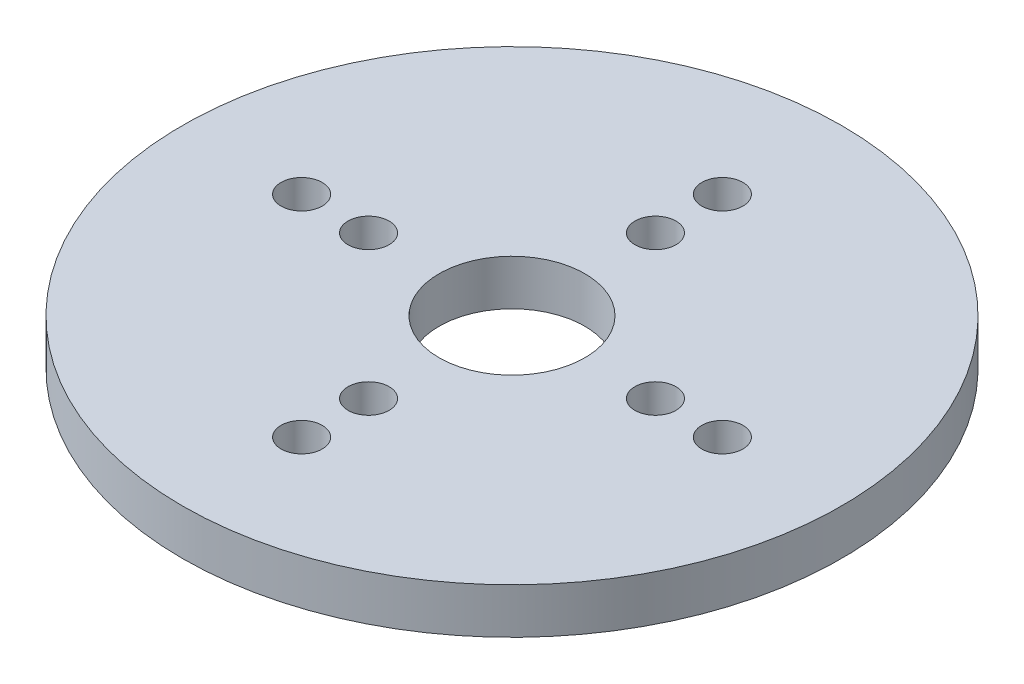
ISO-10303-21;
HEADER;
FILE_DESCRIPTION(('STEP AP214'),'2;1');
FILE_NAME('part.step','',(''),(''),'','','');
FILE_SCHEMA(('AUTOMOTIVE_DESIGN { 1 0 10303 214 1 1 1 1 }'));
ENDSEC;
DATA;
#1=APPLICATION_CONTEXT('core data for automotive mechanical design processes');
#2=APPLICATION_PROTOCOL_DEFINITION('international standard','automotive_design',2000,#1);
#3=PRODUCT_CONTEXT('',#1,'mechanical');
#4=PRODUCT('Part','Part','',(#3));
#5=PRODUCT_RELATED_PRODUCT_CATEGORY('part','',(#4));
#6=PRODUCT_DEFINITION_FORMATION('','',#4);
#7=PRODUCT_DEFINITION_CONTEXT('part definition',#1,'design');
#8=PRODUCT_DEFINITION('design','',#6,#7);
#9=PRODUCT_DEFINITION_SHAPE('','',#8);
#10=(LENGTH_UNIT() NAMED_UNIT(*) SI_UNIT(.MILLI.,.METRE.));
#11=(NAMED_UNIT(*) PLANE_ANGLE_UNIT() SI_UNIT($,.RADIAN.));
#12=(NAMED_UNIT(*) SI_UNIT($,.STERADIAN.) SOLID_ANGLE_UNIT());
#13=UNCERTAINTY_MEASURE_WITH_UNIT(LENGTH_MEASURE(1.E-05),#10,'distance_accuracy_value','');
#14=(GEOMETRIC_REPRESENTATION_CONTEXT(3) GLOBAL_UNCERTAINTY_ASSIGNED_CONTEXT((#13)) GLOBAL_UNIT_ASSIGNED_CONTEXT((#10,
#11,#12)) REPRESENTATION_CONTEXT('',''));
#15=CARTESIAN_POINT('',(0.,0.,0.));
#16=DIRECTION('',(0.,0.,1.));
#17=DIRECTION('',(1.,0.,0.));
#18=AXIS2_PLACEMENT_3D('',#15,#16,#17);
#19=CARTESIAN_POINT('',(0.,4.7625,8.26465172548552));
#20=DIRECTION('',(0.,-1.,0.));
#21=DIRECTION('',(0.,0.,-1.));
#22=AXIS2_PLACEMENT_3D('',#19,#20,#21);
#23=CYLINDRICAL_SURFACE('',#22,7.62);
#24=CARTESIAN_POINT('',(0.,4.7625,8.26465172548552));
#25=DIRECTION('',(0.,1.,0.));
#26=DIRECTION('',(0.,0.,1.));
#27=AXIS2_PLACEMENT_3D('',#24,#25,#26);
#28=CIRCLE('',#27,7.62);
#29=CARTESIAN_POINT('',(0.,4.7625,15.8846517254855));
#30=VERTEX_POINT('',#29);
#31=EDGE_CURVE('E46',#30,#30,#28,.T.);
#32=ORIENTED_EDGE('',*,*,#31,.T.);
#33=EDGE_LOOP('',(#32));
#34=FACE_BOUND('',#33,.T.);
#35=CARTESIAN_POINT('',(0.,0.,8.26465172548552));
#36=DIRECTION('',(0.,1.,0.));
#37=DIRECTION('',(0.,0.,1.));
#38=AXIS2_PLACEMENT_3D('',#35,#36,#37);
#39=CIRCLE('',#38,7.62);
#40=CARTESIAN_POINT('',(0.,0.,15.8846517254855));
#41=VERTEX_POINT('',#40);
#42=EDGE_CURVE('E78',#41,#41,#39,.T.);
#43=ORIENTED_EDGE('',*,*,#42,.F.);
#44=EDGE_LOOP('',(#43));
#45=FACE_BOUND('',#44,.T.);
#46=ADVANCED_FACE('F38',(#34,#45),#23,.F.);
#47=CARTESIAN_POINT('',(2.32452945780892E-13,4.7625,-13.7353482745145));
#48=DIRECTION('',(0.,-1.,0.));
#49=DIRECTION('',(0.,0.,-1.));
#50=AXIS2_PLACEMENT_3D('',#47,#48,#49);
#51=CYLINDRICAL_SURFACE('',#50,2.15);
#52=CARTESIAN_POINT('',(2.32452945780892E-13,4.7625,-13.7353482745145));
#53=DIRECTION('',(0.,1.,0.));
#54=DIRECTION('',(0.,0.,1.));
#55=AXIS2_PLACEMENT_3D('',#52,#53,#54);
#56=CIRCLE('',#55,2.15);
#57=CARTESIAN_POINT('',(2.32452945780892E-13,4.7625,-11.5853482745145));
#58=VERTEX_POINT('',#57);
#59=EDGE_CURVE('E51',#58,#58,#56,.T.);
#60=ORIENTED_EDGE('',*,*,#59,.T.);
#61=EDGE_LOOP('',(#60));
#62=FACE_BOUND('',#61,.T.);
#63=CARTESIAN_POINT('',(2.32452945780892E-13,0.,-13.7353482745145));
#64=DIRECTION('',(0.,1.,0.));
#65=DIRECTION('',(0.,0.,1.));
#66=AXIS2_PLACEMENT_3D('',#63,#64,#65);
#67=CIRCLE('',#66,2.15);
#68=CARTESIAN_POINT('',(2.32452945780892E-13,0.,-11.5853482745145));
#69=VERTEX_POINT('',#68);
#70=EDGE_CURVE('E76',#69,#69,#67,.T.);
#71=ORIENTED_EDGE('',*,*,#70,.F.);
#72=EDGE_LOOP('',(#71));
#73=FACE_BOUND('',#72,.T.);
#74=ADVANCED_FACE('F111',(#62,#73),#51,.F.);
#75=CARTESIAN_POINT('',(1.59594559789866E-13,4.7625,-6.73534827451449));
#76=DIRECTION('',(0.,-1.,0.));
#77=DIRECTION('',(0.,0.,-1.));
#78=AXIS2_PLACEMENT_3D('',#75,#76,#77);
#79=CYLINDRICAL_SURFACE('',#78,2.15);
#80=CARTESIAN_POINT('',(1.59594559789866E-13,4.7625,-6.73534827451449));
#81=DIRECTION('',(0.,1.,0.));
#82=DIRECTION('',(0.,0.,1.));
#83=AXIS2_PLACEMENT_3D('',#80,#81,#82);
#84=CIRCLE('',#83,2.15);
#85=CARTESIAN_POINT('',(1.59594559789866E-13,4.7625,-4.58534827451449));
#86=VERTEX_POINT('',#85);
#87=EDGE_CURVE('E106',#86,#86,#84,.T.);
#88=ORIENTED_EDGE('',*,*,#87,.T.);
#89=EDGE_LOOP('',(#88));
#90=FACE_BOUND('',#89,.T.);
#91=CARTESIAN_POINT('',(1.59594559789866E-13,0.,-6.73534827451449));
#92=DIRECTION('',(0.,1.,0.));
#93=DIRECTION('',(0.,0.,1.));
#94=AXIS2_PLACEMENT_3D('',#91,#92,#93);
#95=CIRCLE('',#94,2.15);
#96=CARTESIAN_POINT('',(1.59594559789866E-13,0.,-4.58534827451449));
#97=VERTEX_POINT('',#96);
#98=EDGE_CURVE('E73',#97,#97,#95,.T.);
#99=ORIENTED_EDGE('',*,*,#98,.F.);
#100=EDGE_LOOP('',(#99));
#101=FACE_BOUND('',#100,.T.);
#102=ADVANCED_FACE('F129',(#90,#101),#79,.F.);
#103=CARTESIAN_POINT('',(-22.,4.7625,8.26465172548536));
#104=DIRECTION('',(0.,-1.,0.));
#105=DIRECTION('',(0.,0.,-1.));
#106=AXIS2_PLACEMENT_3D('',#103,#104,#105);
#107=CYLINDRICAL_SURFACE('',#106,2.15);
#108=CARTESIAN_POINT('',(-22.,4.7625,8.26465172548536));
#109=DIRECTION('',(0.,1.,0.));
#110=DIRECTION('',(0.,0.,1.));
#111=AXIS2_PLACEMENT_3D('',#108,#109,#110);
#112=CIRCLE('',#111,2.15);
#113=CARTESIAN_POINT('',(-22.,4.7625,10.4146517254854));
#114=VERTEX_POINT('',#113);
#115=EDGE_CURVE('E103',#114,#114,#112,.T.);
#116=ORIENTED_EDGE('',*,*,#115,.T.);
#117=EDGE_LOOP('',(#116));
#118=FACE_BOUND('',#117,.T.);
#119=CARTESIAN_POINT('',(-22.,0.,8.26465172548536));
#120=DIRECTION('',(0.,1.,0.));
#121=DIRECTION('',(0.,0.,1.));
#122=AXIS2_PLACEMENT_3D('',#119,#120,#121);
#123=CIRCLE('',#122,2.15);
#124=CARTESIAN_POINT('',(-22.,0.,10.4146517254854));
#125=VERTEX_POINT('',#124);
#126=EDGE_CURVE('E70',#125,#125,#123,.T.);
#127=ORIENTED_EDGE('',*,*,#126,.F.);
#128=EDGE_LOOP('',(#127));
#129=FACE_BOUND('',#128,.T.);
#130=ADVANCED_FACE('F136',(#118,#129),#107,.F.);
#131=CARTESIAN_POINT('',(-15.,4.7625,8.26465172548541));
#132=DIRECTION('',(0.,-1.,0.));
#133=DIRECTION('',(0.,0.,-1.));
#134=AXIS2_PLACEMENT_3D('',#131,#132,#133);
#135=CYLINDRICAL_SURFACE('',#134,2.15);
#136=CARTESIAN_POINT('',(-15.,4.7625,8.26465172548541));
#137=DIRECTION('',(0.,1.,0.));
#138=DIRECTION('',(0.,0.,1.));
#139=AXIS2_PLACEMENT_3D('',#136,#137,#138);
#140=CIRCLE('',#139,2.15);
#141=CARTESIAN_POINT('',(-15.,4.7625,10.4146517254854));
#142=VERTEX_POINT('',#141);
#143=EDGE_CURVE('E100',#142,#142,#140,.T.);
#144=ORIENTED_EDGE('',*,*,#143,.T.);
#145=EDGE_LOOP('',(#144));
#146=FACE_BOUND('',#145,.T.);
#147=CARTESIAN_POINT('',(-15.,0.,8.26465172548541));
#148=DIRECTION('',(0.,1.,0.));
#149=DIRECTION('',(0.,0.,1.));
#150=AXIS2_PLACEMENT_3D('',#147,#148,#149);
#151=CIRCLE('',#150,2.15);
#152=CARTESIAN_POINT('',(-15.,0.,10.4146517254854));
#153=VERTEX_POINT('',#152);
#154=EDGE_CURVE('E67',#153,#153,#151,.T.);
#155=ORIENTED_EDGE('',*,*,#154,.F.);
#156=EDGE_LOOP('',(#155));
#157=FACE_BOUND('',#156,.T.);
#158=ADVANCED_FACE('F140',(#146,#157),#135,.F.);
#159=CARTESIAN_POINT('',(22.,4.7625,8.26465172548552));
#160=DIRECTION('',(0.,-1.,0.));
#161=DIRECTION('',(0.,0.,-1.));
#162=AXIS2_PLACEMENT_3D('',#159,#160,#161);
#163=CYLINDRICAL_SURFACE('',#162,2.15);
#164=CARTESIAN_POINT('',(22.,4.7625,8.26465172548552));
#165=DIRECTION('',(0.,1.,0.));
#166=DIRECTION('',(0.,0.,1.));
#167=AXIS2_PLACEMENT_3D('',#164,#165,#166);
#168=CIRCLE('',#167,2.15);
#169=CARTESIAN_POINT('',(22.,4.7625,10.4146517254855));
#170=VERTEX_POINT('',#169);
#171=EDGE_CURVE('E97',#170,#170,#168,.T.);
#172=ORIENTED_EDGE('',*,*,#171,.T.);
#173=EDGE_LOOP('',(#172));
#174=FACE_BOUND('',#173,.T.);
#175=CARTESIAN_POINT('',(22.,0.,8.26465172548552));
#176=DIRECTION('',(0.,1.,0.));
#177=DIRECTION('',(0.,0.,1.));
#178=AXIS2_PLACEMENT_3D('',#175,#176,#177);
#179=CIRCLE('',#178,2.15);
#180=CARTESIAN_POINT('',(22.,0.,10.4146517254855));
#181=VERTEX_POINT('',#180);
#182=EDGE_CURVE('E64',#181,#181,#179,.T.);
#183=ORIENTED_EDGE('',*,*,#182,.F.);
#184=EDGE_LOOP('',(#183));
#185=FACE_BOUND('',#184,.T.);
#186=ADVANCED_FACE('F144',(#174,#185),#163,.F.);
#187=CARTESIAN_POINT('',(15.,4.7625,8.26465172548552));
#188=DIRECTION('',(0.,-1.,0.));
#189=DIRECTION('',(0.,0.,-1.));
#190=AXIS2_PLACEMENT_3D('',#187,#188,#189);
#191=CYLINDRICAL_SURFACE('',#190,2.15);
#192=CARTESIAN_POINT('',(15.,4.7625,8.26465172548552));
#193=DIRECTION('',(0.,1.,0.));
#194=DIRECTION('',(0.,0.,1.));
#195=AXIS2_PLACEMENT_3D('',#192,#193,#194);
#196=CIRCLE('',#195,2.15);
#197=CARTESIAN_POINT('',(15.,4.7625,10.4146517254855));
#198=VERTEX_POINT('',#197);
#199=EDGE_CURVE('E92',#198,#198,#196,.T.);
#200=ORIENTED_EDGE('',*,*,#199,.T.);
#201=EDGE_LOOP('',(#200));
#202=FACE_BOUND('',#201,.T.);
#203=CARTESIAN_POINT('',(15.,0.,8.26465172548552));
#204=DIRECTION('',(0.,1.,0.));
#205=DIRECTION('',(0.,0.,1.));
#206=AXIS2_PLACEMENT_3D('',#203,#204,#205);
#207=CIRCLE('',#206,2.15);
#208=CARTESIAN_POINT('',(15.,0.,10.4146517254855));
#209=VERTEX_POINT('',#208);
#210=EDGE_CURVE('E61',#209,#209,#207,.T.);
#211=ORIENTED_EDGE('',*,*,#210,.F.);
#212=EDGE_LOOP('',(#211));
#213=FACE_BOUND('',#212,.T.);
#214=ADVANCED_FACE('F148',(#202,#213),#191,.F.);
#215=CARTESIAN_POINT('',(0.,4.7625,30.2646517254855));
#216=DIRECTION('',(0.,-1.,0.));
#217=DIRECTION('',(0.,0.,-1.));
#218=AXIS2_PLACEMENT_3D('',#215,#216,#217);
#219=CYLINDRICAL_SURFACE('',#218,2.15);
#220=CARTESIAN_POINT('',(0.,4.7625,30.2646517254855));
#221=DIRECTION('',(0.,1.,0.));
#222=DIRECTION('',(0.,0.,1.));
#223=AXIS2_PLACEMENT_3D('',#220,#221,#222);
#224=CIRCLE('',#223,2.15);
#225=CARTESIAN_POINT('',(0.,4.7625,32.4146517254855));
#226=VERTEX_POINT('',#225);
#227=EDGE_CURVE('E87',#226,#226,#224,.T.);
#228=ORIENTED_EDGE('',*,*,#227,.T.);
#229=EDGE_LOOP('',(#228));
#230=FACE_BOUND('',#229,.T.);
#231=CARTESIAN_POINT('',(0.,0.,30.2646517254855));
#232=DIRECTION('',(0.,1.,0.));
#233=DIRECTION('',(0.,0.,1.));
#234=AXIS2_PLACEMENT_3D('',#231,#232,#233);
#235=CIRCLE('',#234,2.15);
#236=CARTESIAN_POINT('',(0.,0.,32.4146517254855));
#237=VERTEX_POINT('',#236);
#238=EDGE_CURVE('E58',#237,#237,#235,.T.);
#239=ORIENTED_EDGE('',*,*,#238,.F.);
#240=EDGE_LOOP('',(#239));
#241=FACE_BOUND('',#240,.T.);
#242=ADVANCED_FACE('F151',(#230,#241),#219,.F.);
#243=CARTESIAN_POINT('',(0.,4.7625,23.2646517254855));
#244=DIRECTION('',(0.,-1.,0.));
#245=DIRECTION('',(0.,0.,-1.));
#246=AXIS2_PLACEMENT_3D('',#243,#244,#245);
#247=CYLINDRICAL_SURFACE('',#246,2.15);
#248=CARTESIAN_POINT('',(0.,4.7625,23.2646517254855));
#249=DIRECTION('',(0.,1.,0.));
#250=DIRECTION('',(0.,0.,1.));
#251=AXIS2_PLACEMENT_3D('',#248,#249,#250);
#252=CIRCLE('',#251,2.15);
#253=CARTESIAN_POINT('',(0.,4.7625,25.4146517254855));
#254=VERTEX_POINT('',#253);
#255=EDGE_CURVE('E83',#254,#254,#252,.T.);
#256=ORIENTED_EDGE('',*,*,#255,.T.);
#257=EDGE_LOOP('',(#256));
#258=FACE_BOUND('',#257,.T.);
#259=CARTESIAN_POINT('',(0.,0.,23.2646517254855));
#260=DIRECTION('',(0.,1.,0.));
#261=DIRECTION('',(0.,0.,1.));
#262=AXIS2_PLACEMENT_3D('',#259,#260,#261);
#263=CIRCLE('',#262,2.15);
#264=CARTESIAN_POINT('',(0.,0.,25.4146517254855));
#265=VERTEX_POINT('',#264);
#266=EDGE_CURVE('E55',#265,#265,#263,.T.);
#267=ORIENTED_EDGE('',*,*,#266,.F.);
#268=EDGE_LOOP('',(#267));
#269=FACE_BOUND('',#268,.T.);
#270=ADVANCED_FACE('F40',(#258,#269),#247,.F.);
#271=CARTESIAN_POINT('',(0.,4.7625,8.26465172548552));
#272=DIRECTION('',(0.,-1.,0.));
#273=DIRECTION('',(0.,0.,-1.));
#274=AXIS2_PLACEMENT_3D('',#271,#272,#273);
#275=CYLINDRICAL_SURFACE('',#274,34.4648584161439);
#276=CARTESIAN_POINT('',(0.,4.7625,8.26465172548552));
#277=DIRECTION('',(0.,1.,0.));
#278=DIRECTION('',(0.,0.,1.));
#279=AXIS2_PLACEMENT_3D('',#276,#277,#278);
#280=CIRCLE('',#279,34.4648584161439);
#281=CARTESIAN_POINT('',(0.,4.7625,42.7295101416294));
#282=VERTEX_POINT('',#281);
#283=EDGE_CURVE('E10',#282,#282,#280,.T.);
#284=ORIENTED_EDGE('',*,*,#283,.F.);
#285=EDGE_LOOP('',(#284));
#286=FACE_BOUND('',#285,.T.);
#287=CARTESIAN_POINT('',(0.,0.,8.26465172548552));
#288=DIRECTION('',(0.,1.,0.));
#289=DIRECTION('',(0.,0.,1.));
#290=AXIS2_PLACEMENT_3D('',#287,#288,#289);
#291=CIRCLE('',#290,34.4648584161439);
#292=CARTESIAN_POINT('',(0.,0.,42.7295101416294));
#293=VERTEX_POINT('',#292);
#294=EDGE_CURVE('E42',#293,#293,#291,.T.);
#295=ORIENTED_EDGE('',*,*,#294,.T.);
#296=EDGE_LOOP('',(#295));
#297=FACE_BOUND('',#296,.T.);
#298=ADVANCED_FACE('F118',(#286,#297),#275,.T.);
#299=CARTESIAN_POINT('',(0.,4.7625,0.));
#300=DIRECTION('',(0.,1.,0.));
#301=DIRECTION('',(0.,0.,1.));
#302=AXIS2_PLACEMENT_3D('',#299,#300,#301);
#303=PLANE('',#302);
#304=ORIENTED_EDGE('',*,*,#255,.F.);
#305=EDGE_LOOP('',(#304));
#306=FACE_BOUND('',#305,.T.);
#307=ORIENTED_EDGE('',*,*,#227,.F.);
#308=EDGE_LOOP('',(#307));
#309=FACE_BOUND('',#308,.T.);
#310=ORIENTED_EDGE('',*,*,#199,.F.);
#311=EDGE_LOOP('',(#310));
#312=FACE_BOUND('',#311,.T.);
#313=ORIENTED_EDGE('',*,*,#171,.F.);
#314=EDGE_LOOP('',(#313));
#315=FACE_BOUND('',#314,.T.);
#316=ORIENTED_EDGE('',*,*,#143,.F.);
#317=EDGE_LOOP('',(#316));
#318=FACE_BOUND('',#317,.T.);
#319=ORIENTED_EDGE('',*,*,#115,.F.);
#320=EDGE_LOOP('',(#319));
#321=FACE_BOUND('',#320,.T.);
#322=ORIENTED_EDGE('',*,*,#87,.F.);
#323=EDGE_LOOP('',(#322));
#324=FACE_BOUND('',#323,.T.);
#325=ORIENTED_EDGE('',*,*,#59,.F.);
#326=EDGE_LOOP('',(#325));
#327=FACE_BOUND('',#326,.T.);
#328=ORIENTED_EDGE('',*,*,#31,.F.);
#329=EDGE_LOOP('',(#328));
#330=FACE_BOUND('',#329,.T.);
#331=ORIENTED_EDGE('',*,*,#283,.T.);
#332=EDGE_LOOP('',(#331));
#333=FACE_BOUND('',#332,.T.);
#334=ADVANCED_FACE('F114',(#306,#309,#312,#315,#318,#321,#324,#327,#330,#333),#303,.T.);
#335=CARTESIAN_POINT('',(0.,0.,0.));
#336=DIRECTION('',(0.,1.,0.));
#337=DIRECTION('',(0.,0.,1.));
#338=AXIS2_PLACEMENT_3D('',#335,#336,#337);
#339=PLANE('',#338);
#340=ORIENTED_EDGE('',*,*,#266,.T.);
#341=EDGE_LOOP('',(#340));
#342=FACE_BOUND('',#341,.T.);
#343=ORIENTED_EDGE('',*,*,#238,.T.);
#344=EDGE_LOOP('',(#343));
#345=FACE_BOUND('',#344,.T.);
#346=ORIENTED_EDGE('',*,*,#210,.T.);
#347=EDGE_LOOP('',(#346));
#348=FACE_BOUND('',#347,.T.);
#349=ORIENTED_EDGE('',*,*,#182,.T.);
#350=EDGE_LOOP('',(#349));
#351=FACE_BOUND('',#350,.T.);
#352=ORIENTED_EDGE('',*,*,#154,.T.);
#353=EDGE_LOOP('',(#352));
#354=FACE_BOUND('',#353,.T.);
#355=ORIENTED_EDGE('',*,*,#126,.T.);
#356=EDGE_LOOP('',(#355));
#357=FACE_BOUND('',#356,.T.);
#358=ORIENTED_EDGE('',*,*,#98,.T.);
#359=EDGE_LOOP('',(#358));
#360=FACE_BOUND('',#359,.T.);
#361=ORIENTED_EDGE('',*,*,#70,.T.);
#362=EDGE_LOOP('',(#361));
#363=FACE_BOUND('',#362,.T.);
#364=ORIENTED_EDGE('',*,*,#42,.T.);
#365=EDGE_LOOP('',(#364));
#366=FACE_BOUND('',#365,.T.);
#367=ORIENTED_EDGE('',*,*,#294,.F.);
#368=EDGE_LOOP('',(#367));
#369=FACE_BOUND('',#368,.T.);
#370=ADVANCED_FACE('F117',(#342,#345,#348,#351,#354,#357,#360,#363,#366,#369),#339,.F.);
#371=CLOSED_SHELL('',(#46,#74,#102,#130,#158,#186,#214,#242,#270,#298,#334,#370));
#372=MANIFOLD_SOLID_BREP('B2',#371);
#373=ADVANCED_BREP_SHAPE_REPRESENTATION('',(#18,#372),#14);
#374=SHAPE_DEFINITION_REPRESENTATION(#9,#373);
ENDSEC;
END-ISO-10303-21;
